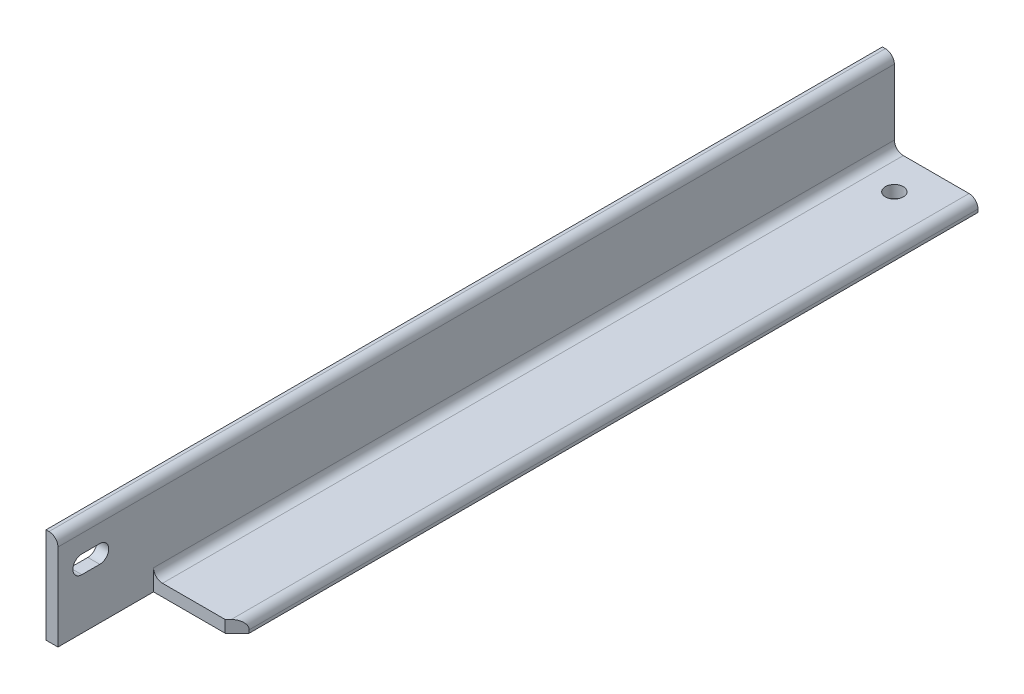
ISO-10303-21;
HEADER;
FILE_DESCRIPTION(('STEP AP214'),'2;1');
FILE_NAME('part.step','',(''),(''),'','','');
FILE_SCHEMA(('AUTOMOTIVE_DESIGN { 1 0 10303 214 1 1 1 1 }'));
ENDSEC;
DATA;
#1=APPLICATION_CONTEXT('core data for automotive mechanical design processes');
#2=APPLICATION_PROTOCOL_DEFINITION('international standard','automotive_design',2000,#1);
#3=PRODUCT_CONTEXT('',#1,'mechanical');
#4=PRODUCT('Part','Part','',(#3));
#5=PRODUCT_RELATED_PRODUCT_CATEGORY('part','',(#4));
#6=PRODUCT_DEFINITION_FORMATION('','',#4);
#7=PRODUCT_DEFINITION_CONTEXT('part definition',#1,'design');
#8=PRODUCT_DEFINITION('design','',#6,#7);
#9=PRODUCT_DEFINITION_SHAPE('','',#8);
#10=(LENGTH_UNIT() NAMED_UNIT(*) SI_UNIT(.MILLI.,.METRE.));
#11=(NAMED_UNIT(*) PLANE_ANGLE_UNIT() SI_UNIT($,.RADIAN.));
#12=(NAMED_UNIT(*) SI_UNIT($,.STERADIAN.) SOLID_ANGLE_UNIT());
#13=UNCERTAINTY_MEASURE_WITH_UNIT(LENGTH_MEASURE(1.E-05),#10,'distance_accuracy_value','');
#14=(GEOMETRIC_REPRESENTATION_CONTEXT(3) GLOBAL_UNCERTAINTY_ASSIGNED_CONTEXT((#13)) GLOBAL_UNIT_ASSIGNED_CONTEXT((#10,
#11,#12)) REPRESENTATION_CONTEXT('',''));
#15=CARTESIAN_POINT('',(0.,0.,0.));
#16=DIRECTION('',(0.,0.,1.));
#17=DIRECTION('',(1.,0.,0.));
#18=AXIS2_PLACEMENT_3D('',#15,#16,#17);
#19=CARTESIAN_POINT('',(101.6,0.,444.5));
#20=DIRECTION('',(0.,1.,0.));
#21=DIRECTION('',(-1.,0.,0.));
#22=AXIS2_PLACEMENT_3D('',#19,#20,#21);
#23=PLANE('',#22);
#24=CARTESIAN_POINT('',(50.8,0.,-406.4));
#25=DIRECTION('',(0.,-1.,0.));
#26=DIRECTION('',(0.,0.,-1.));
#27=AXIS2_PLACEMENT_3D('',#24,#25,#26);
#28=CIRCLE('',#27,9.52499999999999);
#29=CARTESIAN_POINT('',(50.8,0.,-415.925));
#30=VERTEX_POINT('',#29);
#31=EDGE_CURVE('E320',#30,#30,#28,.T.);
#32=ORIENTED_EDGE('',*,*,#31,.F.);
#33=EDGE_LOOP('',(#32));
#34=FACE_BOUND('',#33,.T.);
#35=DIRECTION('',(0.,0.,-1.));
#36=VECTOR('',#35,1.);
#37=CARTESIAN_POINT('',(101.6,0.,444.5));
#38=LINE('',#37,#36);
#39=CARTESIAN_POINT('',(101.6,0.,330.2));
#40=VERTEX_POINT('',#39);
#41=CARTESIAN_POINT('',(101.6,0.,-444.5));
#42=VERTEX_POINT('',#41);
#43=EDGE_CURVE('E11',#40,#42,#38,.T.);
#44=ORIENTED_EDGE('',*,*,#43,.F.);
#45=DIRECTION('',(0.707106781186548,0.,-0.707106781186547));
#46=VECTOR('',#45,1.);
#47=CARTESIAN_POINT('',(88.9,0.,342.9));
#48=LINE('',#47,#46);
#49=CARTESIAN_POINT('',(88.9,0.,342.9));
#50=VERTEX_POINT('',#49);
#51=EDGE_CURVE('E191',#50,#40,#48,.T.);
#52=ORIENTED_EDGE('',*,*,#51,.F.);
#53=DIRECTION('',(1.,0.,0.));
#54=VECTOR('',#53,1.);
#55=CARTESIAN_POINT('',(88.9,0.,342.9));
#56=LINE('',#55,#54);
#57=CARTESIAN_POINT('',(12.7,0.,342.9));
#58=VERTEX_POINT('',#57);
#59=EDGE_CURVE('E188',#58,#50,#56,.T.);
#60=ORIENTED_EDGE('',*,*,#59,.F.);
#61=DIRECTION('',(0.,0.,-1.));
#62=VECTOR('',#61,1.);
#63=CARTESIAN_POINT('',(12.7,0.,342.9));
#64=LINE('',#63,#62);
#65=CARTESIAN_POINT('',(12.7,0.,444.5));
#66=VERTEX_POINT('',#65);
#67=EDGE_CURVE('E185',#66,#58,#64,.T.);
#68=ORIENTED_EDGE('',*,*,#67,.F.);
#69=DIRECTION('',(1.,0.,0.));
#70=VECTOR('',#69,1.);
#71=CARTESIAN_POINT('',(101.6,0.,444.5));
#72=LINE('',#71,#70);
#73=CARTESIAN_POINT('',(0.,0.,444.5));
#74=VERTEX_POINT('',#73);
#75=EDGE_CURVE('E201',#74,#66,#72,.T.);
#76=ORIENTED_EDGE('',*,*,#75,.F.);
#77=DIRECTION('',(0.,0.,-1.));
#78=VECTOR('',#77,1.);
#79=CARTESIAN_POINT('',(0.,0.,444.5));
#80=LINE('',#79,#78);
#81=CARTESIAN_POINT('',(0.,0.,-444.5));
#82=VERTEX_POINT('',#81);
#83=EDGE_CURVE('E213',#74,#82,#80,.T.);
#84=ORIENTED_EDGE('',*,*,#83,.T.);
#85=DIRECTION('',(1.,0.,0.));
#86=VECTOR('',#85,1.);
#87=CARTESIAN_POINT('',(101.6,0.,-444.5));
#88=LINE('',#87,#86);
#89=EDGE_CURVE('E197',#82,#42,#88,.T.);
#90=ORIENTED_EDGE('',*,*,#89,.T.);
#91=EDGE_LOOP('',(#44,#52,#60,#68,#76,#84,#90));
#92=FACE_BOUND('',#91,.T.);
#93=ADVANCED_FACE('F35',(#34,#92),#23,.F.);
#94=CARTESIAN_POINT('',(101.6,3.18008,444.5));
#95=DIRECTION('',(-1.,0.,0.));
#96=DIRECTION('',(0.,0.,1.));
#97=AXIS2_PLACEMENT_3D('',#94,#95,#96);
#98=PLANE('',#97);
#99=DIRECTION('',(0.,0.,-1.));
#100=VECTOR('',#99,1.);
#101=CARTESIAN_POINT('',(101.6,3.18008,444.5));
#102=LINE('',#101,#100);
#103=CARTESIAN_POINT('',(101.6,3.18008,330.2));
#104=VERTEX_POINT('',#103);
#105=CARTESIAN_POINT('',(101.6,3.18008,-444.5));
#106=VERTEX_POINT('',#105);
#107=EDGE_CURVE('E43',#104,#106,#102,.T.);
#108=ORIENTED_EDGE('',*,*,#107,.F.);
#109=DIRECTION('',(0.,-1.,0.));
#110=VECTOR('',#109,1.);
#111=CARTESIAN_POINT('',(101.6,101.601,330.2));
#112=LINE('',#111,#110);
#113=EDGE_CURVE('E194',#104,#40,#112,.T.);
#114=ORIENTED_EDGE('',*,*,#113,.T.);
#115=ORIENTED_EDGE('',*,*,#43,.T.);
#116=DIRECTION('',(0.,1.,0.));
#117=VECTOR('',#116,1.);
#118=CARTESIAN_POINT('',(101.6,3.18008,-444.5));
#119=LINE('',#118,#117);
#120=EDGE_CURVE('E216',#42,#106,#119,.T.);
#121=ORIENTED_EDGE('',*,*,#120,.T.);
#122=EDGE_LOOP('',(#108,#114,#115,#121));
#123=FACE_BOUND('',#122,.T.);
#124=ADVANCED_FACE('F261',(#123),#98,.F.);
#125=CARTESIAN_POINT('',(92.08008,3.18008,444.5));
#126=DIRECTION('',(0.,0.,-1.));
#127=DIRECTION('',(-1.,0.,0.));
#128=AXIS2_PLACEMENT_3D('',#125,#126,#127);
#129=CYLINDRICAL_SURFACE('',#128,9.51991999999999);
#130=DIRECTION('',(0.,0.,-1.));
#131=VECTOR('',#130,1.);
#132=CARTESIAN_POINT('',(92.08008,12.7,444.5));
#133=LINE('',#132,#131);
#134=CARTESIAN_POINT('',(92.08008,12.7,339.71992));
#135=VERTEX_POINT('',#134);
#136=CARTESIAN_POINT('',(92.08008,12.7,-444.5));
#137=VERTEX_POINT('',#136);
#138=EDGE_CURVE('E250',#135,#137,#133,.T.);
#139=ORIENTED_EDGE('',*,*,#138,.F.);
#140=CARTESIAN_POINT('',(92.08008,3.18008,339.71992));
#141=DIRECTION('',(-0.707106781186547,0.,-0.707106781186548));
#142=DIRECTION('',(0.707106781186548,0.,-0.707106781186547));
#143=AXIS2_PLACEMENT_3D('',#140,#141,#142);
#144=ELLIPSE('',#143,13.4631999767068,9.51991999999999);
#145=EDGE_CURVE('E155',#104,#135,#144,.F.);
#146=ORIENTED_EDGE('',*,*,#145,.F.);
#147=ORIENTED_EDGE('',*,*,#107,.T.);
#148=CARTESIAN_POINT('',(92.08008,3.18008,-444.5));
#149=DIRECTION('',(0.,0.,1.));
#150=DIRECTION('',(1.,0.,0.));
#151=AXIS2_PLACEMENT_3D('',#148,#149,#150);
#152=CIRCLE('',#151,9.51991999999999);
#153=EDGE_CURVE('E219',#106,#137,#152,.T.);
#154=ORIENTED_EDGE('',*,*,#153,.T.);
#155=EDGE_LOOP('',(#139,#146,#147,#154));
#156=FACE_BOUND('',#155,.T.);
#157=ADVANCED_FACE('F256',(#156),#129,.T.);
#158=CARTESIAN_POINT('',(22.225,12.7,444.5));
#159=DIRECTION('',(0.,-1.,0.));
#160=DIRECTION('',(1.,0.,0.));
#161=AXIS2_PLACEMENT_3D('',#158,#159,#160);
#162=PLANE('',#161);
#163=CARTESIAN_POINT('',(50.8,12.7,-406.4));
#164=DIRECTION('',(0.,-1.,0.));
#165=DIRECTION('',(1.,0.,0.));
#166=AXIS2_PLACEMENT_3D('',#163,#164,#165);
#167=CIRCLE('',#166,9.52499999999999);
#168=CARTESIAN_POINT('',(60.325,12.7,-406.4));
#169=VERTEX_POINT('',#168);
#170=EDGE_CURVE('E38',#169,#169,#167,.T.);
#171=ORIENTED_EDGE('',*,*,#170,.T.);
#172=EDGE_LOOP('',(#171));
#173=FACE_BOUND('',#172,.T.);
#174=DIRECTION('',(-1.,0.,0.));
#175=VECTOR('',#174,1.);
#176=CARTESIAN_POINT('',(88.9,12.7,342.9));
#177=LINE('',#176,#175);
#178=CARTESIAN_POINT('',(88.9,12.7,342.9));
#179=VERTEX_POINT('',#178);
#180=CARTESIAN_POINT('',(22.225,12.7,342.9));
#181=VERTEX_POINT('',#180);
#182=EDGE_CURVE('E181',#179,#181,#177,.T.);
#183=ORIENTED_EDGE('',*,*,#182,.F.);
#184=DIRECTION('',(-0.707106781186548,0.,0.707106781186547));
#185=VECTOR('',#184,1.);
#186=CARTESIAN_POINT('',(88.9,12.7,342.9));
#187=LINE('',#186,#185);
#188=EDGE_CURVE('E183',#135,#179,#187,.T.);
#189=ORIENTED_EDGE('',*,*,#188,.F.);
#190=ORIENTED_EDGE('',*,*,#138,.T.);
#191=DIRECTION('',(-1.,0.,0.));
#192=VECTOR('',#191,1.);
#193=CARTESIAN_POINT('',(22.225,12.7,-444.5));
#194=LINE('',#193,#192);
#195=CARTESIAN_POINT('',(22.225,12.7,-444.5));
#196=VERTEX_POINT('',#195);
#197=EDGE_CURVE('E222',#137,#196,#194,.T.);
#198=ORIENTED_EDGE('',*,*,#197,.T.);
#199=DIRECTION('',(0.,0.,-1.));
#200=VECTOR('',#199,1.);
#201=CARTESIAN_POINT('',(22.225,12.7,444.5));
#202=LINE('',#201,#200);
#203=EDGE_CURVE('E248',#181,#196,#202,.T.);
#204=ORIENTED_EDGE('',*,*,#203,.F.);
#205=EDGE_LOOP('',(#183,#189,#190,#198,#204));
#206=FACE_BOUND('',#205,.T.);
#207=ADVANCED_FACE('F271',(#173,#206),#162,.F.);
#208=CARTESIAN_POINT('',(22.225,22.225,444.5));
#209=DIRECTION('',(0.,0.,-1.));
#210=DIRECTION('',(-1.,0.,0.));
#211=AXIS2_PLACEMENT_3D('',#208,#209,#210);
#212=CYLINDRICAL_SURFACE('',#211,9.525);
#213=DIRECTION('',(0.,0.,-1.));
#214=VECTOR('',#213,1.);
#215=CARTESIAN_POINT('',(12.7,22.225,444.5));
#216=LINE('',#215,#214);
#217=CARTESIAN_POINT('',(12.7,22.225,342.9));
#218=VERTEX_POINT('',#217);
#219=CARTESIAN_POINT('',(12.7,22.225,-444.5));
#220=VERTEX_POINT('',#219);
#221=EDGE_CURVE('E246',#218,#220,#216,.T.);
#222=ORIENTED_EDGE('',*,*,#221,.F.);
#223=CARTESIAN_POINT('',(22.225,22.225,342.9));
#224=DIRECTION('',(0.,0.,-1.));
#225=DIRECTION('',(-1.,0.,0.));
#226=AXIS2_PLACEMENT_3D('',#223,#224,#225);
#227=CIRCLE('',#226,9.525);
#228=EDGE_CURVE('E179',#181,#218,#227,.T.);
#229=ORIENTED_EDGE('',*,*,#228,.F.);
#230=ORIENTED_EDGE('',*,*,#203,.T.);
#231=CARTESIAN_POINT('',(22.225,22.225,-444.5));
#232=DIRECTION('',(0.,0.,-1.));
#233=DIRECTION('',(-1.,0.,0.));
#234=AXIS2_PLACEMENT_3D('',#231,#232,#233);
#235=CIRCLE('',#234,9.525);
#236=EDGE_CURVE('E225',#196,#220,#235,.T.);
#237=ORIENTED_EDGE('',*,*,#236,.T.);
#238=EDGE_LOOP('',(#222,#229,#230,#237));
#239=FACE_BOUND('',#238,.T.);
#240=ADVANCED_FACE('F303',(#239),#212,.F.);
#241=CARTESIAN_POINT('',(12.7,92.08008,444.5));
#242=DIRECTION('',(-1.,0.,0.));
#243=DIRECTION('',(0.,-1.,0.));
#244=AXIS2_PLACEMENT_3D('',#241,#242,#243);
#245=PLANE('',#244);
#246=DIRECTION('',(0.,0.,-1.));
#247=VECTOR('',#246,1.);
#248=CARTESIAN_POINT('',(12.7,53.975,419.1));
#249=LINE('',#248,#247);
#250=CARTESIAN_POINT('',(12.7,53.975,419.1));
#251=VERTEX_POINT('',#250);
#252=CARTESIAN_POINT('',(12.7,53.975,400.05));
#253=VERTEX_POINT('',#252);
#254=EDGE_CURVE('E161',#251,#253,#249,.T.);
#255=ORIENTED_EDGE('',*,*,#254,.F.);
#256=CARTESIAN_POINT('',(12.7,63.5,419.1));
#257=DIRECTION('',(-1.,0.,0.));
#258=DIRECTION('',(0.,-1.,0.));
#259=AXIS2_PLACEMENT_3D('',#256,#257,#258);
#260=CIRCLE('',#259,9.525);
#261=CARTESIAN_POINT('',(12.7,73.025,419.1));
#262=VERTEX_POINT('',#261);
#263=EDGE_CURVE('E143',#262,#251,#260,.F.);
#264=ORIENTED_EDGE('',*,*,#263,.F.);
#265=DIRECTION('',(0.,0.,1.));
#266=VECTOR('',#265,1.);
#267=CARTESIAN_POINT('',(12.7,73.025,419.1));
#268=LINE('',#267,#266);
#269=CARTESIAN_POINT('',(12.7,73.025,400.05));
#270=VERTEX_POINT('',#269);
#271=EDGE_CURVE('E152',#270,#262,#268,.T.);
#272=ORIENTED_EDGE('',*,*,#271,.F.);
#273=CARTESIAN_POINT('',(12.7,63.5,400.05));
#274=DIRECTION('',(-1.,0.,0.));
#275=DIRECTION('',(0.,-1.,0.));
#276=AXIS2_PLACEMENT_3D('',#273,#274,#275);
#277=CIRCLE('',#276,9.52499999999999);
#278=EDGE_CURVE('E50',#253,#270,#277,.F.);
#279=ORIENTED_EDGE('',*,*,#278,.F.);
#280=EDGE_LOOP('',(#255,#264,#272,#279));
#281=FACE_BOUND('',#280,.T.);
#282=DIRECTION('',(0.,1.,0.));
#283=VECTOR('',#282,1.);
#284=CARTESIAN_POINT('',(12.7,92.08008,-444.5));
#285=LINE('',#284,#283);
#286=CARTESIAN_POINT('',(12.7,92.08008,-444.5));
#287=VERTEX_POINT('',#286);
#288=EDGE_CURVE('E228',#220,#287,#285,.T.);
#289=ORIENTED_EDGE('',*,*,#288,.T.);
#290=DIRECTION('',(0.,0.,-1.));
#291=VECTOR('',#290,1.);
#292=CARTESIAN_POINT('',(12.7,92.08008,444.5));
#293=LINE('',#292,#291);
#294=CARTESIAN_POINT('',(12.7,92.08008,444.5));
#295=VERTEX_POINT('',#294);
#296=EDGE_CURVE('E243',#295,#287,#293,.T.);
#297=ORIENTED_EDGE('',*,*,#296,.F.);
#298=DIRECTION('',(0.,1.,0.));
#299=VECTOR('',#298,1.);
#300=CARTESIAN_POINT('',(12.7,92.08008,444.5));
#301=LINE('',#300,#299);
#302=EDGE_CURVE('E204',#66,#295,#301,.T.);
#303=ORIENTED_EDGE('',*,*,#302,.F.);
#304=ORIENTED_EDGE('',*,*,#67,.T.);
#305=DIRECTION('',(0.,-1.,0.));
#306=VECTOR('',#305,1.);
#307=CARTESIAN_POINT('',(12.7,101.601,342.9));
#308=LINE('',#307,#306);
#309=EDGE_CURVE('E193',#218,#58,#308,.T.);
#310=ORIENTED_EDGE('',*,*,#309,.F.);
#311=ORIENTED_EDGE('',*,*,#221,.T.);
#312=EDGE_LOOP('',(#289,#297,#303,#304,#310,#311));
#313=FACE_BOUND('',#312,.T.);
#314=ADVANCED_FACE('F158',(#281,#313),#245,.F.);
#315=CARTESIAN_POINT('',(3.18008,92.08008,444.5));
#316=DIRECTION('',(0.,0.,-1.));
#317=DIRECTION('',(-1.,0.,0.));
#318=AXIS2_PLACEMENT_3D('',#315,#316,#317);
#319=CYLINDRICAL_SURFACE('',#318,9.51992);
#320=CARTESIAN_POINT('',(3.18008,92.08008,-444.5));
#321=DIRECTION('',(0.,0.,1.));
#322=DIRECTION('',(-1.,0.,0.));
#323=AXIS2_PLACEMENT_3D('',#320,#321,#322);
#324=CIRCLE('',#323,9.51992);
#325=CARTESIAN_POINT('',(3.18008,101.6,-444.5));
#326=VERTEX_POINT('',#325);
#327=EDGE_CURVE('E230',#287,#326,#324,.T.);
#328=ORIENTED_EDGE('',*,*,#327,.T.);
#329=DIRECTION('',(0.,0.,-1.));
#330=VECTOR('',#329,1.);
#331=CARTESIAN_POINT('',(3.18008,101.6,444.5));
#332=LINE('',#331,#330);
#333=CARTESIAN_POINT('',(3.18008,101.6,444.5));
#334=VERTEX_POINT('',#333);
#335=EDGE_CURVE('E240',#334,#326,#332,.T.);
#336=ORIENTED_EDGE('',*,*,#335,.F.);
#337=CARTESIAN_POINT('',(3.18008,92.08008,444.5));
#338=DIRECTION('',(0.,0.,1.));
#339=DIRECTION('',(-1.,0.,0.));
#340=AXIS2_PLACEMENT_3D('',#337,#338,#339);
#341=CIRCLE('',#340,9.51992);
#342=EDGE_CURVE('E207',#295,#334,#341,.T.);
#343=ORIENTED_EDGE('',*,*,#342,.F.);
#344=ORIENTED_EDGE('',*,*,#296,.T.);
#345=EDGE_LOOP('',(#328,#336,#343,#344));
#346=FACE_BOUND('',#345,.T.);
#347=ADVANCED_FACE('F299',(#346),#319,.T.);
#348=CARTESIAN_POINT('',(0.,101.6,444.5));
#349=DIRECTION('',(0.,-1.,0.));
#350=DIRECTION('',(0.,0.,-1.));
#351=AXIS2_PLACEMENT_3D('',#348,#349,#350);
#352=PLANE('',#351);
#353=DIRECTION('',(-1.,0.,0.));
#354=VECTOR('',#353,1.);
#355=CARTESIAN_POINT('',(0.,101.6,-444.5));
#356=LINE('',#355,#354);
#357=CARTESIAN_POINT('',(0.,101.6,-444.5));
#358=VERTEX_POINT('',#357);
#359=EDGE_CURVE('E232',#326,#358,#356,.T.);
#360=ORIENTED_EDGE('',*,*,#359,.T.);
#361=DIRECTION('',(0.,0.,-1.));
#362=VECTOR('',#361,1.);
#363=CARTESIAN_POINT('',(0.,101.6,444.5));
#364=LINE('',#363,#362);
#365=CARTESIAN_POINT('',(0.,101.6,444.5));
#366=VERTEX_POINT('',#365);
#367=EDGE_CURVE('E237',#366,#358,#364,.T.);
#368=ORIENTED_EDGE('',*,*,#367,.F.);
#369=DIRECTION('',(-1.,0.,0.));
#370=VECTOR('',#369,1.);
#371=CARTESIAN_POINT('',(0.,101.6,444.5));
#372=LINE('',#371,#370);
#373=EDGE_CURVE('E209',#334,#366,#372,.T.);
#374=ORIENTED_EDGE('',*,*,#373,.F.);
#375=ORIENTED_EDGE('',*,*,#335,.T.);
#376=EDGE_LOOP('',(#360,#368,#374,#375));
#377=FACE_BOUND('',#376,.T.);
#378=ADVANCED_FACE('F295',(#377),#352,.F.);
#379=CARTESIAN_POINT('',(0.,0.,444.5));
#380=DIRECTION('',(1.,0.,0.));
#381=DIRECTION('',(0.,0.,-1.));
#382=AXIS2_PLACEMENT_3D('',#379,#380,#381);
#383=PLANE('',#382);
#384=DIRECTION('',(0.,0.,-1.));
#385=VECTOR('',#384,1.);
#386=CARTESIAN_POINT('',(0.,73.025,419.1));
#387=LINE('',#386,#385);
#388=CARTESIAN_POINT('',(0.,73.025,419.1));
#389=VERTEX_POINT('',#388);
#390=CARTESIAN_POINT('',(0.,73.025,400.05));
#391=VERTEX_POINT('',#390);
#392=EDGE_CURVE('E163',#389,#391,#387,.T.);
#393=ORIENTED_EDGE('',*,*,#392,.F.);
#394=CARTESIAN_POINT('',(0.,63.5,419.1));
#395=DIRECTION('',(-1.,0.,0.));
#396=DIRECTION('',(0.,0.,1.));
#397=AXIS2_PLACEMENT_3D('',#394,#395,#396);
#398=CIRCLE('',#397,9.525);
#399=CARTESIAN_POINT('',(0.,53.975,419.1));
#400=VERTEX_POINT('',#399);
#401=EDGE_CURVE('E58',#400,#389,#398,.T.);
#402=ORIENTED_EDGE('',*,*,#401,.F.);
#403=DIRECTION('',(0.,0.,1.));
#404=VECTOR('',#403,1.);
#405=CARTESIAN_POINT('',(0.,53.975,419.1));
#406=LINE('',#405,#404);
#407=CARTESIAN_POINT('',(0.,53.975,400.05));
#408=VERTEX_POINT('',#407);
#409=EDGE_CURVE('E149',#408,#400,#406,.T.);
#410=ORIENTED_EDGE('',*,*,#409,.F.);
#411=CARTESIAN_POINT('',(0.,63.5,400.05));
#412=DIRECTION('',(-1.,0.,0.));
#413=DIRECTION('',(0.,0.,1.));
#414=AXIS2_PLACEMENT_3D('',#411,#412,#413);
#415=CIRCLE('',#414,9.52499999999999);
#416=EDGE_CURVE('E169',#391,#408,#415,.T.);
#417=ORIENTED_EDGE('',*,*,#416,.F.);
#418=EDGE_LOOP('',(#393,#402,#410,#417));
#419=FACE_BOUND('',#418,.T.);
#420=DIRECTION('',(0.,-1.,0.));
#421=VECTOR('',#420,1.);
#422=CARTESIAN_POINT('',(0.,0.,-444.5));
#423=LINE('',#422,#421);
#424=EDGE_CURVE('E205',#358,#82,#423,.T.);
#425=ORIENTED_EDGE('',*,*,#424,.T.);
#426=ORIENTED_EDGE('',*,*,#83,.F.);
#427=DIRECTION('',(0.,-1.,0.));
#428=VECTOR('',#427,1.);
#429=CARTESIAN_POINT('',(0.,0.,444.5));
#430=LINE('',#429,#428);
#431=EDGE_CURVE('E211',#366,#74,#430,.T.);
#432=ORIENTED_EDGE('',*,*,#431,.F.);
#433=ORIENTED_EDGE('',*,*,#367,.T.);
#434=EDGE_LOOP('',(#425,#426,#432,#433));
#435=FACE_BOUND('',#434,.T.);
#436=ADVANCED_FACE('F290',(#419,#435),#383,.F.);
#437=CARTESIAN_POINT('',(3.18008,92.08008,444.5));
#438=DIRECTION('',(0.,0.,-1.));
#439=DIRECTION('',(-1.,0.,0.));
#440=AXIS2_PLACEMENT_3D('',#437,#438,#439);
#441=PLANE('',#440);
#442=ORIENTED_EDGE('',*,*,#75,.T.);
#443=ORIENTED_EDGE('',*,*,#302,.T.);
#444=ORIENTED_EDGE('',*,*,#342,.T.);
#445=ORIENTED_EDGE('',*,*,#373,.T.);
#446=ORIENTED_EDGE('',*,*,#431,.T.);
#447=EDGE_LOOP('',(#442,#443,#444,#445,#446));
#448=FACE_BOUND('',#447,.T.);
#449=ADVANCED_FACE('F347',(#448),#441,.F.);
#450=CARTESIAN_POINT('',(3.18008,92.08008,-444.5));
#451=DIRECTION('',(0.,0.,-1.));
#452=DIRECTION('',(-1.,0.,0.));
#453=AXIS2_PLACEMENT_3D('',#450,#451,#452);
#454=PLANE('',#453);
#455=ORIENTED_EDGE('',*,*,#89,.F.);
#456=ORIENTED_EDGE('',*,*,#424,.F.);
#457=ORIENTED_EDGE('',*,*,#359,.F.);
#458=ORIENTED_EDGE('',*,*,#327,.F.);
#459=ORIENTED_EDGE('',*,*,#288,.F.);
#460=ORIENTED_EDGE('',*,*,#236,.F.);
#461=ORIENTED_EDGE('',*,*,#197,.F.);
#462=ORIENTED_EDGE('',*,*,#153,.F.);
#463=ORIENTED_EDGE('',*,*,#120,.F.);
#464=EDGE_LOOP('',(#455,#456,#457,#458,#459,#460,#461,#462,#463));
#465=FACE_BOUND('',#464,.T.);
#466=ADVANCED_FACE('F265',(#465),#454,.T.);
#467=CARTESIAN_POINT('',(88.9,101.601,342.9));
#468=DIRECTION('',(-0.707106781186547,0.,-0.707106781186548));
#469=DIRECTION('',(-0.707106781186548,0.,0.707106781186547));
#470=AXIS2_PLACEMENT_3D('',#467,#468,#469);
#471=PLANE('',#470);
#472=ORIENTED_EDGE('',*,*,#145,.T.);
#473=ORIENTED_EDGE('',*,*,#188,.T.);
#474=DIRECTION('',(0.,-1.,0.));
#475=VECTOR('',#474,1.);
#476=CARTESIAN_POINT('',(88.9,101.601,342.9));
#477=LINE('',#476,#475);
#478=EDGE_CURVE('E198',#179,#50,#477,.T.);
#479=ORIENTED_EDGE('',*,*,#478,.T.);
#480=ORIENTED_EDGE('',*,*,#51,.T.);
#481=ORIENTED_EDGE('',*,*,#113,.F.);
#482=EDGE_LOOP('',(#472,#473,#479,#480,#481));
#483=FACE_BOUND('',#482,.T.);
#484=ADVANCED_FACE('F275',(#483),#471,.F.);
#485=CARTESIAN_POINT('',(88.9,101.601,342.9));
#486=DIRECTION('',(0.,0.,-1.));
#487=DIRECTION('',(-1.,0.,0.));
#488=AXIS2_PLACEMENT_3D('',#485,#486,#487);
#489=PLANE('',#488);
#490=ORIENTED_EDGE('',*,*,#182,.T.);
#491=ORIENTED_EDGE('',*,*,#228,.T.);
#492=ORIENTED_EDGE('',*,*,#309,.T.);
#493=ORIENTED_EDGE('',*,*,#59,.T.);
#494=ORIENTED_EDGE('',*,*,#478,.F.);
#495=EDGE_LOOP('',(#490,#491,#492,#493,#494));
#496=FACE_BOUND('',#495,.T.);
#497=ADVANCED_FACE('F277',(#496),#489,.F.);
#498=CARTESIAN_POINT('',(101.601,63.5,419.1));
#499=DIRECTION('',(-1.,0.,0.));
#500=DIRECTION('',(0.,0.,1.));
#501=AXIS2_PLACEMENT_3D('',#498,#499,#500);
#502=CYLINDRICAL_SURFACE('',#501,9.525);
#503=ORIENTED_EDGE('',*,*,#263,.T.);
#504=DIRECTION('',(-1.,0.,0.));
#505=VECTOR('',#504,1.);
#506=CARTESIAN_POINT('',(101.601,53.975,419.1));
#507=LINE('',#506,#505);
#508=EDGE_CURVE('E156',#251,#400,#507,.T.);
#509=ORIENTED_EDGE('',*,*,#508,.T.);
#510=ORIENTED_EDGE('',*,*,#401,.T.);
#511=DIRECTION('',(-1.,0.,0.));
#512=VECTOR('',#511,1.);
#513=CARTESIAN_POINT('',(101.601,73.025,419.1));
#514=LINE('',#513,#512);
#515=EDGE_CURVE('E139',#262,#389,#514,.T.);
#516=ORIENTED_EDGE('',*,*,#515,.F.);
#517=EDGE_LOOP('',(#503,#509,#510,#516));
#518=FACE_BOUND('',#517,.T.);
#519=ADVANCED_FACE('F141',(#518),#502,.F.);
#520=CARTESIAN_POINT('',(101.601,53.975,419.1));
#521=DIRECTION('',(0.,-1.,0.));
#522=DIRECTION('',(0.,0.,-1.));
#523=AXIS2_PLACEMENT_3D('',#520,#521,#522);
#524=PLANE('',#523);
#525=ORIENTED_EDGE('',*,*,#254,.T.);
#526=DIRECTION('',(-1.,0.,0.));
#527=VECTOR('',#526,1.);
#528=CARTESIAN_POINT('',(101.601,53.975,400.05));
#529=LINE('',#528,#527);
#530=EDGE_CURVE('E175',#253,#408,#529,.T.);
#531=ORIENTED_EDGE('',*,*,#530,.T.);
#532=ORIENTED_EDGE('',*,*,#409,.T.);
#533=ORIENTED_EDGE('',*,*,#508,.F.);
#534=EDGE_LOOP('',(#525,#531,#532,#533));
#535=FACE_BOUND('',#534,.T.);
#536=ADVANCED_FACE('F335',(#535),#524,.F.);
#537=CARTESIAN_POINT('',(101.601,63.5,400.05));
#538=DIRECTION('',(-1.,0.,0.));
#539=DIRECTION('',(0.,0.,1.));
#540=AXIS2_PLACEMENT_3D('',#537,#538,#539);
#541=CYLINDRICAL_SURFACE('',#540,9.52499999999999);
#542=ORIENTED_EDGE('',*,*,#278,.T.);
#543=DIRECTION('',(-1.,0.,0.));
#544=VECTOR('',#543,1.);
#545=CARTESIAN_POINT('',(101.601,73.025,400.05));
#546=LINE('',#545,#544);
#547=EDGE_CURVE('E148',#270,#391,#546,.T.);
#548=ORIENTED_EDGE('',*,*,#547,.T.);
#549=ORIENTED_EDGE('',*,*,#416,.T.);
#550=ORIENTED_EDGE('',*,*,#530,.F.);
#551=EDGE_LOOP('',(#542,#548,#549,#550));
#552=FACE_BOUND('',#551,.T.);
#553=ADVANCED_FACE('F332',(#552),#541,.F.);
#554=CARTESIAN_POINT('',(101.601,73.025,419.1));
#555=DIRECTION('',(0.,1.,0.));
#556=DIRECTION('',(0.,0.,1.));
#557=AXIS2_PLACEMENT_3D('',#554,#555,#556);
#558=PLANE('',#557);
#559=ORIENTED_EDGE('',*,*,#271,.T.);
#560=ORIENTED_EDGE('',*,*,#515,.T.);
#561=ORIENTED_EDGE('',*,*,#392,.T.);
#562=ORIENTED_EDGE('',*,*,#547,.F.);
#563=EDGE_LOOP('',(#559,#560,#561,#562));
#564=FACE_BOUND('',#563,.T.);
#565=ADVANCED_FACE('F153',(#564),#558,.F.);
#566=CARTESIAN_POINT('',(50.8,0.,-406.4));
#567=DIRECTION('',(0.,-1.,0.));
#568=DIRECTION('',(0.,0.,-1.));
#569=AXIS2_PLACEMENT_3D('',#566,#567,#568);
#570=CYLINDRICAL_SURFACE('',#569,9.52499999999999);
#571=ORIENTED_EDGE('',*,*,#31,.T.);
#572=EDGE_LOOP('',(#571));
#573=FACE_BOUND('',#572,.T.);
#574=ORIENTED_EDGE('',*,*,#170,.F.);
#575=EDGE_LOOP('',(#574));
#576=FACE_BOUND('',#575,.T.);
#577=ADVANCED_FACE('F326',(#573,#576),#570,.F.);
#578=CLOSED_SHELL('',(#93,#124,#157,#207,#240,#314,#347,#378,#436,#449,#466,#484,#497,#519,#536,
#553,#565,#577));
#579=MANIFOLD_SOLID_BREP('B2',#578);
#580=ADVANCED_BREP_SHAPE_REPRESENTATION('',(#18,#579),#14);
#581=SHAPE_DEFINITION_REPRESENTATION(#9,#580);
ENDSEC;
END-ISO-10303-21;
